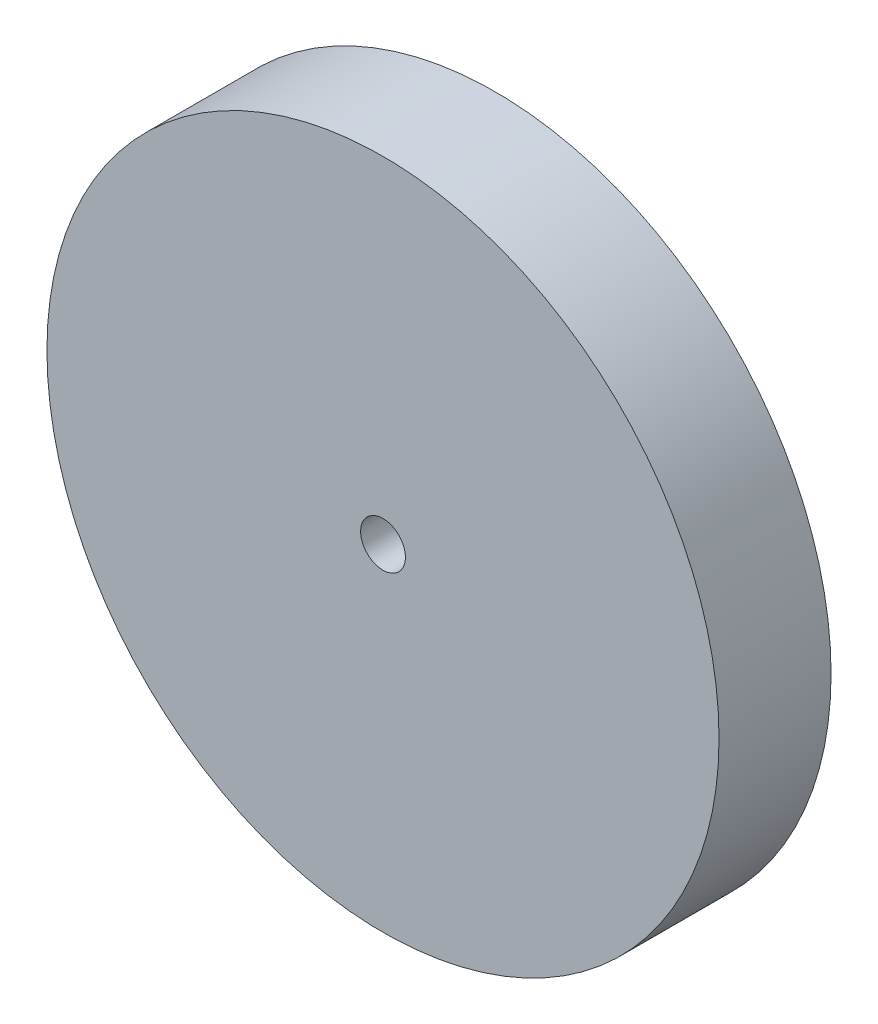
ISO-10303-21;
HEADER;
FILE_DESCRIPTION(('STEP AP214'),'2;1');
FILE_NAME('part.step','',(''),(''),'','','');
FILE_SCHEMA(('AUTOMOTIVE_DESIGN { 1 0 10303 214 1 1 1 1 }'));
ENDSEC;
DATA;
#1=APPLICATION_CONTEXT('core data for automotive mechanical design processes');
#2=APPLICATION_PROTOCOL_DEFINITION('international standard','automotive_design',2000,#1);
#3=PRODUCT_CONTEXT('',#1,'mechanical');
#4=PRODUCT('Part','Part','',(#3));
#5=PRODUCT_RELATED_PRODUCT_CATEGORY('part','',(#4));
#6=PRODUCT_DEFINITION_FORMATION('','',#4);
#7=PRODUCT_DEFINITION_CONTEXT('part definition',#1,'design');
#8=PRODUCT_DEFINITION('design','',#6,#7);
#9=PRODUCT_DEFINITION_SHAPE('','',#8);
#10=(LENGTH_UNIT() NAMED_UNIT(*) SI_UNIT(.MILLI.,.METRE.));
#11=(NAMED_UNIT(*) PLANE_ANGLE_UNIT() SI_UNIT($,.RADIAN.));
#12=(NAMED_UNIT(*) SI_UNIT($,.STERADIAN.) SOLID_ANGLE_UNIT());
#13=UNCERTAINTY_MEASURE_WITH_UNIT(LENGTH_MEASURE(1.E-05),#10,'distance_accuracy_value','');
#14=(GEOMETRIC_REPRESENTATION_CONTEXT(3) GLOBAL_UNCERTAINTY_ASSIGNED_CONTEXT((#13)) GLOBAL_UNIT_ASSIGNED_CONTEXT((#10,
#11,#12)) REPRESENTATION_CONTEXT('',''));
#15=CARTESIAN_POINT('',(0.,0.,0.));
#16=DIRECTION('',(0.,0.,1.));
#17=DIRECTION('',(1.,0.,0.));
#18=AXIS2_PLACEMENT_3D('',#15,#16,#17);
#19=CARTESIAN_POINT('',(0.,0.,20.));
#20=DIRECTION('',(0.,0.,1.));
#21=DIRECTION('',(1.,0.,0.));
#22=AXIS2_PLACEMENT_3D('',#19,#20,#21);
#23=PLANE('',#22);
#24=CARTESIAN_POINT('',(0.,0.,20.));
#25=DIRECTION('',(0.,0.,1.));
#26=DIRECTION('',(1.,0.,0.));
#27=AXIS2_PLACEMENT_3D('',#24,#25,#26);
#28=CIRCLE('',#27,60.);
#29=CARTESIAN_POINT('',(60.,0.,20.));
#30=VERTEX_POINT('',#29);
#31=EDGE_CURVE('E10',#30,#30,#28,.T.);
#32=ORIENTED_EDGE('',*,*,#31,.T.);
#33=EDGE_LOOP('',(#32));
#34=FACE_BOUND('',#33,.T.);
#35=CARTESIAN_POINT('',(0.,0.,20.));
#36=DIRECTION('',(0.,0.,1.));
#37=DIRECTION('',(1.,0.,0.));
#38=AXIS2_PLACEMENT_3D('',#35,#36,#37);
#39=CIRCLE('',#38,4.);
#40=CARTESIAN_POINT('',(4.,0.,20.));
#41=VERTEX_POINT('',#40);
#42=EDGE_CURVE('E42',#41,#41,#39,.T.);
#43=ORIENTED_EDGE('',*,*,#42,.F.);
#44=EDGE_LOOP('',(#43));
#45=FACE_BOUND('',#44,.T.);
#46=ADVANCED_FACE('F31',(#34,#45),#23,.T.);
#47=CARTESIAN_POINT('',(0.,0.,0.));
#48=DIRECTION('',(0.,0.,1.));
#49=DIRECTION('',(1.,0.,0.));
#50=AXIS2_PLACEMENT_3D('',#47,#48,#49);
#51=PLANE('',#50);
#52=CARTESIAN_POINT('',(0.,0.,0.));
#53=DIRECTION('',(0.,0.,1.));
#54=DIRECTION('',(1.,0.,0.));
#55=AXIS2_PLACEMENT_3D('',#52,#53,#54);
#56=CIRCLE('',#55,60.);
#57=CARTESIAN_POINT('',(60.,0.,0.));
#58=VERTEX_POINT('',#57);
#59=EDGE_CURVE('E35',#58,#58,#56,.T.);
#60=ORIENTED_EDGE('',*,*,#59,.F.);
#61=EDGE_LOOP('',(#60));
#62=FACE_BOUND('',#61,.T.);
#63=CARTESIAN_POINT('',(0.,0.,0.));
#64=DIRECTION('',(0.,0.,1.));
#65=DIRECTION('',(1.,0.,0.));
#66=AXIS2_PLACEMENT_3D('',#63,#64,#65);
#67=CIRCLE('',#66,4.);
#68=CARTESIAN_POINT('',(4.,0.,0.));
#69=VERTEX_POINT('',#68);
#70=EDGE_CURVE('E44',#69,#69,#67,.T.);
#71=ORIENTED_EDGE('',*,*,#70,.T.);
#72=EDGE_LOOP('',(#71));
#73=FACE_BOUND('',#72,.T.);
#74=ADVANCED_FACE('F54',(#62,#73),#51,.F.);
#75=CARTESIAN_POINT('',(0.,0.,20.));
#76=DIRECTION('',(0.,0.,-1.));
#77=DIRECTION('',(-1.,0.,0.));
#78=AXIS2_PLACEMENT_3D('',#75,#76,#77);
#79=CYLINDRICAL_SURFACE('',#78,60.);
#80=ORIENTED_EDGE('',*,*,#31,.F.);
#81=EDGE_LOOP('',(#80));
#82=FACE_BOUND('',#81,.T.);
#83=ORIENTED_EDGE('',*,*,#59,.T.);
#84=EDGE_LOOP('',(#83));
#85=FACE_BOUND('',#84,.T.);
#86=ADVANCED_FACE('F33',(#82,#85),#79,.T.);
#87=CARTESIAN_POINT('',(0.,0.,20.));
#88=DIRECTION('',(0.,0.,-1.));
#89=DIRECTION('',(-1.,0.,0.));
#90=AXIS2_PLACEMENT_3D('',#87,#88,#89);
#91=CYLINDRICAL_SURFACE('',#90,4.);
#92=ORIENTED_EDGE('',*,*,#42,.T.);
#93=EDGE_LOOP('',(#92));
#94=FACE_BOUND('',#93,.T.);
#95=ORIENTED_EDGE('',*,*,#70,.F.);
#96=EDGE_LOOP('',(#95));
#97=FACE_BOUND('',#96,.T.);
#98=ADVANCED_FACE('F50',(#94,#97),#91,.F.);
#99=CLOSED_SHELL('',(#46,#74,#86,#98));
#100=MANIFOLD_SOLID_BREP('B2',#99);
#101=ADVANCED_BREP_SHAPE_REPRESENTATION('',(#18,#100),#14);
#102=SHAPE_DEFINITION_REPRESENTATION(#9,#101);
ENDSEC;
END-ISO-10303-21;
